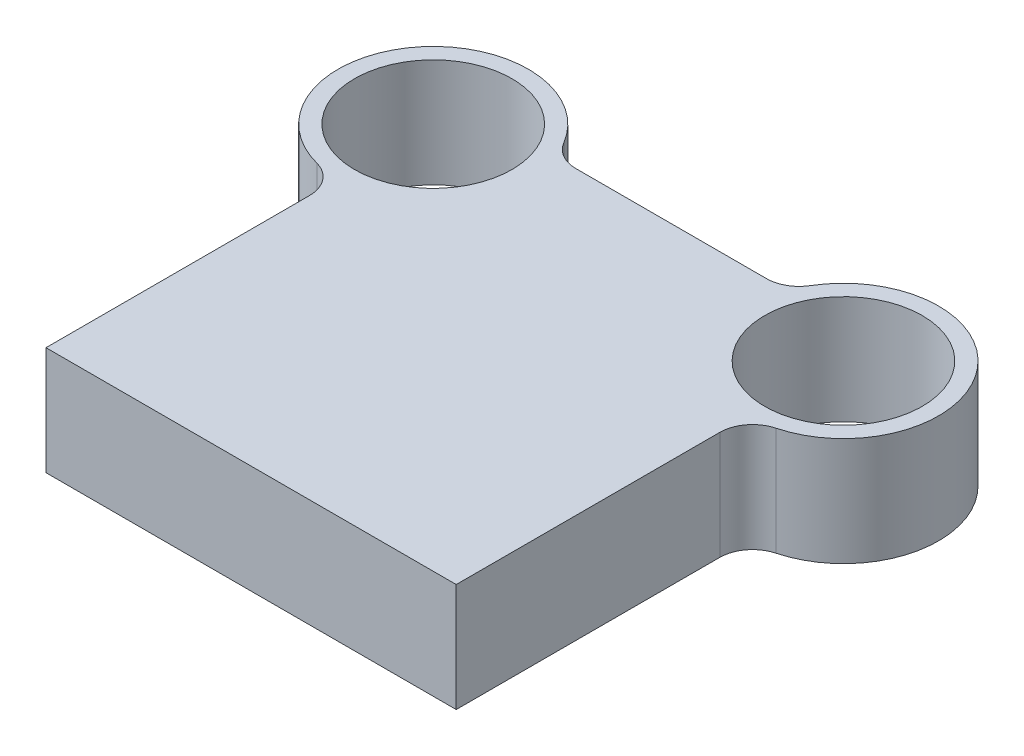
ISO-10303-21;
HEADER;
FILE_DESCRIPTION(('STEP AP214'),'2;1');
FILE_NAME('part.step','',(''),(''),'','','');
FILE_SCHEMA(('AUTOMOTIVE_DESIGN { 1 0 10303 214 1 1 1 1 }'));
ENDSEC;
DATA;
#1=APPLICATION_CONTEXT('core data for automotive mechanical design processes');
#2=APPLICATION_PROTOCOL_DEFINITION('international standard','automotive_design',2000,#1);
#3=PRODUCT_CONTEXT('',#1,'mechanical');
#4=PRODUCT('Part','Part','',(#3));
#5=PRODUCT_RELATED_PRODUCT_CATEGORY('part','',(#4));
#6=PRODUCT_DEFINITION_FORMATION('','',#4);
#7=PRODUCT_DEFINITION_CONTEXT('part definition',#1,'design');
#8=PRODUCT_DEFINITION('design','',#6,#7);
#9=PRODUCT_DEFINITION_SHAPE('','',#8);
#10=(LENGTH_UNIT() NAMED_UNIT(*) SI_UNIT(.MILLI.,.METRE.));
#11=(NAMED_UNIT(*) PLANE_ANGLE_UNIT() SI_UNIT($,.RADIAN.));
#12=(NAMED_UNIT(*) SI_UNIT($,.STERADIAN.) SOLID_ANGLE_UNIT());
#13=UNCERTAINTY_MEASURE_WITH_UNIT(LENGTH_MEASURE(1.E-05),#10,'distance_accuracy_value','');
#14=(GEOMETRIC_REPRESENTATION_CONTEXT(3) GLOBAL_UNCERTAINTY_ASSIGNED_CONTEXT((#13)) GLOBAL_UNIT_ASSIGNED_CONTEXT((#10,
#11,#12)) REPRESENTATION_CONTEXT('',''));
#15=CARTESIAN_POINT('',(0.,0.,0.));
#16=DIRECTION('',(0.,0.,1.));
#17=DIRECTION('',(1.,0.,0.));
#18=AXIS2_PLACEMENT_3D('',#15,#16,#17);
#19=CARTESIAN_POINT('',(-62.5,33.,-118.));
#20=DIRECTION('',(0.,1.,0.));
#21=DIRECTION('',(0.,0.,1.));
#22=AXIS2_PLACEMENT_3D('',#19,#20,#21);
#23=PLANE('',#22);
#24=CARTESIAN_POINT('',(-62.5,33.,-118.));
#25=DIRECTION('',(0.,1.,0.));
#26=DIRECTION('',(0.,0.,1.));
#27=AXIS2_PLACEMENT_3D('',#24,#25,#26);
#28=CIRCLE('',#27,24.);
#29=CARTESIAN_POINT('',(-62.5,33.,-94.));
#30=VERTEX_POINT('',#29);
#31=EDGE_CURVE('E209',#30,#30,#28,.T.);
#32=ORIENTED_EDGE('',*,*,#31,.F.);
#33=EDGE_LOOP('',(#32));
#34=FACE_BOUND('',#33,.T.);
#35=CARTESIAN_POINT('',(-62.5,33.,-118.));
#36=DIRECTION('',(0.,1.,0.));
#37=DIRECTION('',(0.,0.,1.));
#38=AXIS2_PLACEMENT_3D('',#35,#36,#37);
#39=CIRCLE('',#38,29.);
#40=CARTESIAN_POINT('',(-37.6036203979122,33.,-132.871794871795));
#41=VERTEX_POINT('',#40);
#42=CARTESIAN_POINT('',(-69.9358974358974,33.,-89.9695267731204));
#43=VERTEX_POINT('',#42);
#44=EDGE_CURVE('E139',#41,#43,#39,.T.);
#45=ORIENTED_EDGE('',*,*,#44,.T.);
#46=CARTESIAN_POINT('',(-72.5,33.,-80.3038463500584));
#47=DIRECTION('',(0.,1.,0.));
#48=DIRECTION('',(0.,0.,1.));
#49=AXIS2_PLACEMENT_3D('',#46,#47,#48);
#50=CIRCLE('',#49,10.);
#51=CARTESIAN_POINT('',(-62.5,33.,-80.3038463500584));
#52=VERTEX_POINT('',#51);
#53=EDGE_CURVE('E116',#43,#52,#50,.F.);
#54=ORIENTED_EDGE('',*,*,#53,.T.);
#55=DIRECTION('',(0.,0.,1.));
#56=VECTOR('',#55,1.);
#57=CARTESIAN_POINT('',(-62.5,33.,0.));
#58=LINE('',#57,#56);
#59=CARTESIAN_POINT('',(-62.5,33.,0.));
#60=VERTEX_POINT('',#59);
#61=EDGE_CURVE('E109',#52,#60,#58,.T.);
#62=ORIENTED_EDGE('',*,*,#61,.T.);
#63=DIRECTION('',(1.,0.,0.));
#64=VECTOR('',#63,1.);
#65=CARTESIAN_POINT('',(62.5,33.,0.));
#66=LINE('',#65,#64);
#67=CARTESIAN_POINT('',(62.5,33.,0.));
#68=VERTEX_POINT('',#67);
#69=EDGE_CURVE('E113',#60,#68,#66,.T.);
#70=ORIENTED_EDGE('',*,*,#69,.T.);
#71=DIRECTION('',(0.,0.,-1.));
#72=VECTOR('',#71,1.);
#73=CARTESIAN_POINT('',(62.5,33.,0.));
#74=LINE('',#73,#72);
#75=CARTESIAN_POINT('',(62.5,33.,-80.3038463500584));
#76=VERTEX_POINT('',#75);
#77=EDGE_CURVE('E129',#68,#76,#74,.T.);
#78=ORIENTED_EDGE('',*,*,#77,.T.);
#79=CARTESIAN_POINT('',(72.5,33.,-80.3038463500584));
#80=DIRECTION('',(0.,1.,0.));
#81=DIRECTION('',(0.,0.,1.));
#82=AXIS2_PLACEMENT_3D('',#79,#80,#81);
#83=CIRCLE('',#82,10.);
#84=CARTESIAN_POINT('',(69.9358974358974,33.,-89.9695267731204));
#85=VERTEX_POINT('',#84);
#86=EDGE_CURVE('E11',#76,#85,#83,.F.);
#87=ORIENTED_EDGE('',*,*,#86,.T.);
#88=CARTESIAN_POINT('',(62.5,33.,-118.));
#89=DIRECTION('',(0.,1.,0.));
#90=DIRECTION('',(0.,0.,-1.));
#91=AXIS2_PLACEMENT_3D('',#88,#89,#90);
#92=CIRCLE('',#91,29.);
#93=CARTESIAN_POINT('',(37.6036203979122,33.,-132.871794871795));
#94=VERTEX_POINT('',#93);
#95=EDGE_CURVE('E175',#85,#94,#92,.T.);
#96=ORIENTED_EDGE('',*,*,#95,.T.);
#97=CARTESIAN_POINT('',(29.0186619144336,33.,-138.));
#98=DIRECTION('',(0.,1.,0.));
#99=DIRECTION('',(0.,0.,1.));
#100=AXIS2_PLACEMENT_3D('',#97,#98,#99);
#101=CIRCLE('',#100,10.);
#102=CARTESIAN_POINT('',(29.0186619144336,33.,-128.));
#103=VERTEX_POINT('',#102);
#104=EDGE_CURVE('E167',#94,#103,#101,.F.);
#105=ORIENTED_EDGE('',*,*,#104,.T.);
#106=DIRECTION('',(-1.,0.,0.));
#107=VECTOR('',#106,1.);
#108=CARTESIAN_POINT('',(35.2786848223676,33.,-128.));
#109=LINE('',#108,#107);
#110=CARTESIAN_POINT('',(-29.0186619144336,33.,-128.));
#111=VERTEX_POINT('',#110);
#112=EDGE_CURVE('E172',#103,#111,#109,.T.);
#113=ORIENTED_EDGE('',*,*,#112,.T.);
#114=CARTESIAN_POINT('',(-29.0186619144336,33.,-138.));
#115=DIRECTION('',(0.,1.,0.));
#116=DIRECTION('',(0.,0.,1.));
#117=AXIS2_PLACEMENT_3D('',#114,#115,#116);
#118=CIRCLE('',#117,10.);
#119=EDGE_CURVE('E163',#111,#41,#118,.F.);
#120=ORIENTED_EDGE('',*,*,#119,.T.);
#121=EDGE_LOOP('',(#45,#54,#62,#70,#78,#87,#96,#105,#113,#120));
#122=FACE_BOUND('',#121,.T.);
#123=CARTESIAN_POINT('',(62.5,33.,-118.));
#124=DIRECTION('',(0.,1.,0.));
#125=DIRECTION('',(0.,0.,-1.));
#126=AXIS2_PLACEMENT_3D('',#123,#124,#125);
#127=CIRCLE('',#126,24.);
#128=CARTESIAN_POINT('',(62.5,33.,-142.));
#129=VERTEX_POINT('',#128);
#130=EDGE_CURVE('E219',#129,#129,#127,.T.);
#131=ORIENTED_EDGE('',*,*,#130,.F.);
#132=EDGE_LOOP('',(#131));
#133=FACE_BOUND('',#132,.T.);
#134=ADVANCED_FACE('F33',(#34,#122,#133),#23,.T.);
#135=CARTESIAN_POINT('',(-62.5,0.,-118.));
#136=DIRECTION('',(0.,1.,0.));
#137=DIRECTION('',(0.,0.,1.));
#138=AXIS2_PLACEMENT_3D('',#135,#136,#137);
#139=PLANE('',#138);
#140=DIRECTION('',(0.,0.,1.));
#141=VECTOR('',#140,1.);
#142=CARTESIAN_POINT('',(-62.5,0.,0.));
#143=LINE('',#142,#141);
#144=CARTESIAN_POINT('',(-62.5,0.,-80.3038463500584));
#145=VERTEX_POINT('',#144);
#146=CARTESIAN_POINT('',(-62.5,0.,0.));
#147=VERTEX_POINT('',#146);
#148=EDGE_CURVE('E133',#145,#147,#143,.T.);
#149=ORIENTED_EDGE('',*,*,#148,.F.);
#150=CARTESIAN_POINT('',(-72.5,0.,-80.3038463500584));
#151=DIRECTION('',(0.,1.,0.));
#152=DIRECTION('',(0.,0.,1.));
#153=AXIS2_PLACEMENT_3D('',#150,#151,#152);
#154=CIRCLE('',#153,10.);
#155=CARTESIAN_POINT('',(-69.9358974358974,0.,-89.9695267731204));
#156=VERTEX_POINT('',#155);
#157=EDGE_CURVE('E158',#145,#156,#154,.T.);
#158=ORIENTED_EDGE('',*,*,#157,.T.);
#159=CARTESIAN_POINT('',(-62.5,0.,-118.));
#160=DIRECTION('',(0.,1.,0.));
#161=DIRECTION('',(0.,0.,1.));
#162=AXIS2_PLACEMENT_3D('',#159,#160,#161);
#163=CIRCLE('',#162,29.);
#164=CARTESIAN_POINT('',(-37.6036203979122,0.,-132.871794871795));
#165=VERTEX_POINT('',#164);
#166=EDGE_CURVE('E121',#165,#156,#163,.T.);
#167=ORIENTED_EDGE('',*,*,#166,.F.);
#168=CARTESIAN_POINT('',(-29.0186619144336,0.,-138.));
#169=DIRECTION('',(0.,1.,0.));
#170=DIRECTION('',(0.,0.,1.));
#171=AXIS2_PLACEMENT_3D('',#168,#169,#170);
#172=CIRCLE('',#171,10.);
#173=CARTESIAN_POINT('',(-29.0186619144336,0.,-128.));
#174=VERTEX_POINT('',#173);
#175=EDGE_CURVE('E161',#165,#174,#172,.T.);
#176=ORIENTED_EDGE('',*,*,#175,.T.);
#177=DIRECTION('',(-1.,0.,0.));
#178=VECTOR('',#177,1.);
#179=CARTESIAN_POINT('',(35.2786848223676,0.,-128.));
#180=LINE('',#179,#178);
#181=CARTESIAN_POINT('',(29.0186619144336,0.,-128.));
#182=VERTEX_POINT('',#181);
#183=EDGE_CURVE('E190',#182,#174,#180,.T.);
#184=ORIENTED_EDGE('',*,*,#183,.F.);
#185=CARTESIAN_POINT('',(29.0186619144336,0.,-138.));
#186=DIRECTION('',(0.,1.,0.));
#187=DIRECTION('',(0.,0.,1.));
#188=AXIS2_PLACEMENT_3D('',#185,#186,#187);
#189=CIRCLE('',#188,10.);
#190=CARTESIAN_POINT('',(37.6036203979122,0.,-132.871794871795));
#191=VERTEX_POINT('',#190);
#192=EDGE_CURVE('E165',#182,#191,#189,.T.);
#193=ORIENTED_EDGE('',*,*,#192,.T.);
#194=CARTESIAN_POINT('',(62.5,0.,-118.));
#195=DIRECTION('',(0.,1.,0.));
#196=DIRECTION('',(0.,0.,-1.));
#197=AXIS2_PLACEMENT_3D('',#194,#195,#196);
#198=CIRCLE('',#197,29.);
#199=CARTESIAN_POINT('',(69.9358974358974,0.,-89.9695267731204));
#200=VERTEX_POINT('',#199);
#201=EDGE_CURVE('E189',#200,#191,#198,.T.);
#202=ORIENTED_EDGE('',*,*,#201,.F.);
#203=CARTESIAN_POINT('',(72.5,0.,-80.3038463500584));
#204=DIRECTION('',(0.,1.,0.));
#205=DIRECTION('',(0.,0.,1.));
#206=AXIS2_PLACEMENT_3D('',#203,#204,#205);
#207=CIRCLE('',#206,10.);
#208=CARTESIAN_POINT('',(62.5,0.,-80.3038463500584));
#209=VERTEX_POINT('',#208);
#210=EDGE_CURVE('E41',#200,#209,#207,.T.);
#211=ORIENTED_EDGE('',*,*,#210,.T.);
#212=DIRECTION('',(0.,0.,-1.));
#213=VECTOR('',#212,1.);
#214=CARTESIAN_POINT('',(62.5,0.,0.));
#215=LINE('',#214,#213);
#216=CARTESIAN_POINT('',(62.5,0.,0.));
#217=VERTEX_POINT('',#216);
#218=EDGE_CURVE('E194',#217,#209,#215,.T.);
#219=ORIENTED_EDGE('',*,*,#218,.F.);
#220=DIRECTION('',(1.,0.,0.));
#221=VECTOR('',#220,1.);
#222=CARTESIAN_POINT('',(62.5,0.,0.));
#223=LINE('',#222,#221);
#224=EDGE_CURVE('E197',#147,#217,#223,.T.);
#225=ORIENTED_EDGE('',*,*,#224,.F.);
#226=EDGE_LOOP('',(#149,#158,#167,#176,#184,#193,#202,#211,#219,#225));
#227=FACE_BOUND('',#226,.T.);
#228=CARTESIAN_POINT('',(-62.5,0.,-118.));
#229=DIRECTION('',(0.,1.,0.));
#230=DIRECTION('',(0.,0.,1.));
#231=AXIS2_PLACEMENT_3D('',#228,#229,#230);
#232=CIRCLE('',#231,24.);
#233=CARTESIAN_POINT('',(-62.5,0.,-94.));
#234=VERTEX_POINT('',#233);
#235=EDGE_CURVE('E212',#234,#234,#232,.T.);
#236=ORIENTED_EDGE('',*,*,#235,.T.);
#237=EDGE_LOOP('',(#236));
#238=FACE_BOUND('',#237,.T.);
#239=CARTESIAN_POINT('',(62.5,0.,-118.));
#240=DIRECTION('',(0.,1.,0.));
#241=DIRECTION('',(0.,0.,-1.));
#242=AXIS2_PLACEMENT_3D('',#239,#240,#241);
#243=CIRCLE('',#242,24.);
#244=CARTESIAN_POINT('',(62.5,0.,-142.));
#245=VERTEX_POINT('',#244);
#246=EDGE_CURVE('E221',#245,#245,#243,.T.);
#247=ORIENTED_EDGE('',*,*,#246,.T.);
#248=EDGE_LOOP('',(#247));
#249=FACE_BOUND('',#248,.T.);
#250=ADVANCED_FACE('F187',(#227,#238,#249),#139,.F.);
#251=CARTESIAN_POINT('',(-62.5,33.,0.));
#252=DIRECTION('',(1.,0.,0.));
#253=DIRECTION('',(0.,0.,-1.));
#254=AXIS2_PLACEMENT_3D('',#251,#252,#253);
#255=PLANE('',#254);
#256=ORIENTED_EDGE('',*,*,#61,.F.);
#257=DIRECTION('',(0.,1.,0.));
#258=VECTOR('',#257,1.);
#259=CARTESIAN_POINT('',(-62.5,0.,-80.3038463500584));
#260=LINE('',#259,#258);
#261=EDGE_CURVE('E135',#52,#145,#260,.F.);
#262=ORIENTED_EDGE('',*,*,#261,.T.);
#263=ORIENTED_EDGE('',*,*,#148,.T.);
#264=DIRECTION('',(0.,-1.,0.));
#265=VECTOR('',#264,1.);
#266=CARTESIAN_POINT('',(-62.5,33.,0.));
#267=LINE('',#266,#265);
#268=EDGE_CURVE('E126',#60,#147,#267,.T.);
#269=ORIENTED_EDGE('',*,*,#268,.F.);
#270=EDGE_LOOP('',(#256,#262,#263,#269));
#271=FACE_BOUND('',#270,.T.);
#272=ADVANCED_FACE('F131',(#271),#255,.F.);
#273=CARTESIAN_POINT('',(62.5,33.,0.));
#274=DIRECTION('',(0.,0.,-1.));
#275=DIRECTION('',(-1.,0.,0.));
#276=AXIS2_PLACEMENT_3D('',#273,#274,#275);
#277=PLANE('',#276);
#278=ORIENTED_EDGE('',*,*,#224,.T.);
#279=DIRECTION('',(0.,-1.,0.));
#280=VECTOR('',#279,1.);
#281=CARTESIAN_POINT('',(62.5,33.,0.));
#282=LINE('',#281,#280);
#283=EDGE_CURVE('E128',#68,#217,#282,.T.);
#284=ORIENTED_EDGE('',*,*,#283,.F.);
#285=ORIENTED_EDGE('',*,*,#69,.F.);
#286=ORIENTED_EDGE('',*,*,#268,.T.);
#287=EDGE_LOOP('',(#278,#284,#285,#286));
#288=FACE_BOUND('',#287,.T.);
#289=ADVANCED_FACE('F125',(#288),#277,.F.);
#290=CARTESIAN_POINT('',(62.5,33.,0.));
#291=DIRECTION('',(-1.,0.,0.));
#292=DIRECTION('',(0.,0.,1.));
#293=AXIS2_PLACEMENT_3D('',#290,#291,#292);
#294=PLANE('',#293);
#295=ORIENTED_EDGE('',*,*,#218,.T.);
#296=DIRECTION('',(0.,1.,0.));
#297=VECTOR('',#296,1.);
#298=CARTESIAN_POINT('',(62.5,33.,-80.3038463500584));
#299=LINE('',#298,#297);
#300=EDGE_CURVE('E48',#209,#76,#299,.T.);
#301=ORIENTED_EDGE('',*,*,#300,.T.);
#302=ORIENTED_EDGE('',*,*,#77,.F.);
#303=ORIENTED_EDGE('',*,*,#283,.T.);
#304=EDGE_LOOP('',(#295,#301,#302,#303));
#305=FACE_BOUND('',#304,.T.);
#306=ADVANCED_FACE('F247',(#305),#294,.F.);
#307=CARTESIAN_POINT('',(62.5,33.,-118.));
#308=DIRECTION('',(0.,-1.,0.));
#309=DIRECTION('',(0.,0.,-1.));
#310=AXIS2_PLACEMENT_3D('',#307,#308,#309);
#311=CYLINDRICAL_SURFACE('',#310,29.);
#312=ORIENTED_EDGE('',*,*,#201,.T.);
#313=DIRECTION('',(0.,-1.,0.));
#314=VECTOR('',#313,1.);
#315=CARTESIAN_POINT('',(37.6036203979122,33.,-132.871794871795));
#316=LINE('',#315,#314);
#317=EDGE_CURVE('E155',#191,#94,#316,.F.);
#318=ORIENTED_EDGE('',*,*,#317,.T.);
#319=ORIENTED_EDGE('',*,*,#95,.F.);
#320=DIRECTION('',(0.,-1.,0.));
#321=VECTOR('',#320,1.);
#322=CARTESIAN_POINT('',(69.9358974358974,33.,-89.9695267731204));
#323=LINE('',#322,#321);
#324=EDGE_CURVE('E152',#85,#200,#323,.T.);
#325=ORIENTED_EDGE('',*,*,#324,.T.);
#326=EDGE_LOOP('',(#312,#318,#319,#325));
#327=FACE_BOUND('',#326,.T.);
#328=ADVANCED_FACE('F192',(#327),#311,.T.);
#329=CARTESIAN_POINT('',(35.2786848223676,33.,-128.));
#330=DIRECTION('',(0.,0.,1.));
#331=DIRECTION('',(1.,0.,0.));
#332=AXIS2_PLACEMENT_3D('',#329,#330,#331);
#333=PLANE('',#332);
#334=ORIENTED_EDGE('',*,*,#183,.T.);
#335=DIRECTION('',(0.,1.,0.));
#336=VECTOR('',#335,1.);
#337=CARTESIAN_POINT('',(-29.0186619144336,33.,-128.));
#338=LINE('',#337,#336);
#339=EDGE_CURVE('E150',#174,#111,#338,.T.);
#340=ORIENTED_EDGE('',*,*,#339,.T.);
#341=ORIENTED_EDGE('',*,*,#112,.F.);
#342=DIRECTION('',(0.,1.,0.));
#343=VECTOR('',#342,1.);
#344=CARTESIAN_POINT('',(29.0186619144336,0.,-128.));
#345=LINE('',#344,#343);
#346=EDGE_CURVE('E147',#103,#182,#345,.F.);
#347=ORIENTED_EDGE('',*,*,#346,.T.);
#348=EDGE_LOOP('',(#334,#340,#341,#347));
#349=FACE_BOUND('',#348,.T.);
#350=ADVANCED_FACE('F181',(#349),#333,.F.);
#351=CARTESIAN_POINT('',(-62.5,33.,-118.));
#352=DIRECTION('',(0.,-1.,0.));
#353=DIRECTION('',(0.,0.,-1.));
#354=AXIS2_PLACEMENT_3D('',#351,#352,#353);
#355=CYLINDRICAL_SURFACE('',#354,29.);
#356=ORIENTED_EDGE('',*,*,#166,.T.);
#357=DIRECTION('',(0.,-1.,0.));
#358=VECTOR('',#357,1.);
#359=CARTESIAN_POINT('',(-69.9358974358974,33.,-89.9695267731204));
#360=LINE('',#359,#358);
#361=EDGE_CURVE('E145',#156,#43,#360,.F.);
#362=ORIENTED_EDGE('',*,*,#361,.T.);
#363=ORIENTED_EDGE('',*,*,#44,.F.);
#364=DIRECTION('',(0.,-1.,0.));
#365=VECTOR('',#364,1.);
#366=CARTESIAN_POINT('',(-37.6036203979122,33.,-132.871794871795));
#367=LINE('',#366,#365);
#368=EDGE_CURVE('E137',#41,#165,#367,.T.);
#369=ORIENTED_EDGE('',*,*,#368,.T.);
#370=EDGE_LOOP('',(#356,#362,#363,#369));
#371=FACE_BOUND('',#370,.T.);
#372=ADVANCED_FACE('F204',(#371),#355,.T.);
#373=CARTESIAN_POINT('',(-62.5,33.,-118.));
#374=DIRECTION('',(0.,-1.,0.));
#375=DIRECTION('',(0.,0.,-1.));
#376=AXIS2_PLACEMENT_3D('',#373,#374,#375);
#377=CYLINDRICAL_SURFACE('',#376,24.);
#378=ORIENTED_EDGE('',*,*,#31,.T.);
#379=EDGE_LOOP('',(#378));
#380=FACE_BOUND('',#379,.T.);
#381=ORIENTED_EDGE('',*,*,#235,.F.);
#382=EDGE_LOOP('',(#381));
#383=FACE_BOUND('',#382,.T.);
#384=ADVANCED_FACE('F238',(#380,#383),#377,.F.);
#385=CARTESIAN_POINT('',(62.5,33.,-118.));
#386=DIRECTION('',(0.,-1.,0.));
#387=DIRECTION('',(0.,0.,-1.));
#388=AXIS2_PLACEMENT_3D('',#385,#386,#387);
#389=CYLINDRICAL_SURFACE('',#388,24.);
#390=ORIENTED_EDGE('',*,*,#130,.T.);
#391=EDGE_LOOP('',(#390));
#392=FACE_BOUND('',#391,.T.);
#393=ORIENTED_EDGE('',*,*,#246,.F.);
#394=EDGE_LOOP('',(#393));
#395=FACE_BOUND('',#394,.T.);
#396=ADVANCED_FACE('F227',(#392,#395),#389,.F.);
#397=CARTESIAN_POINT('',(-72.5,33.,-80.3038463500584));
#398=DIRECTION('',(0.,-1.,0.));
#399=DIRECTION('',(0.,0.,-1.));
#400=AXIS2_PLACEMENT_3D('',#397,#398,#399);
#401=CYLINDRICAL_SURFACE('',#400,10.);
#402=ORIENTED_EDGE('',*,*,#53,.F.);
#403=ORIENTED_EDGE('',*,*,#361,.F.);
#404=ORIENTED_EDGE('',*,*,#157,.F.);
#405=ORIENTED_EDGE('',*,*,#261,.F.);
#406=EDGE_LOOP('',(#402,#403,#404,#405));
#407=FACE_BOUND('',#406,.T.);
#408=ADVANCED_FACE('F208',(#407),#401,.F.);
#409=CARTESIAN_POINT('',(-29.0186619144336,33.,-138.));
#410=DIRECTION('',(0.,-1.,0.));
#411=DIRECTION('',(0.,0.,-1.));
#412=AXIS2_PLACEMENT_3D('',#409,#410,#411);
#413=CYLINDRICAL_SURFACE('',#412,10.);
#414=ORIENTED_EDGE('',*,*,#119,.F.);
#415=ORIENTED_EDGE('',*,*,#339,.F.);
#416=ORIENTED_EDGE('',*,*,#175,.F.);
#417=ORIENTED_EDGE('',*,*,#368,.F.);
#418=EDGE_LOOP('',(#414,#415,#416,#417));
#419=FACE_BOUND('',#418,.T.);
#420=ADVANCED_FACE('F256',(#419),#413,.F.);
#421=CARTESIAN_POINT('',(29.0186619144336,33.,-138.));
#422=DIRECTION('',(0.,-1.,0.));
#423=DIRECTION('',(0.,0.,-1.));
#424=AXIS2_PLACEMENT_3D('',#421,#422,#423);
#425=CYLINDRICAL_SURFACE('',#424,10.);
#426=ORIENTED_EDGE('',*,*,#104,.F.);
#427=ORIENTED_EDGE('',*,*,#317,.F.);
#428=ORIENTED_EDGE('',*,*,#192,.F.);
#429=ORIENTED_EDGE('',*,*,#346,.F.);
#430=EDGE_LOOP('',(#426,#427,#428,#429));
#431=FACE_BOUND('',#430,.T.);
#432=ADVANCED_FACE('F185',(#431),#425,.F.);
#433=CARTESIAN_POINT('',(72.5,33.,-80.3038463500584));
#434=DIRECTION('',(0.,-1.,0.));
#435=DIRECTION('',(0.,0.,-1.));
#436=AXIS2_PLACEMENT_3D('',#433,#434,#435);
#437=CYLINDRICAL_SURFACE('',#436,10.);
#438=ORIENTED_EDGE('',*,*,#86,.F.);
#439=ORIENTED_EDGE('',*,*,#300,.F.);
#440=ORIENTED_EDGE('',*,*,#210,.F.);
#441=ORIENTED_EDGE('',*,*,#324,.F.);
#442=EDGE_LOOP('',(#438,#439,#440,#441));
#443=FACE_BOUND('',#442,.T.);
#444=ADVANCED_FACE('F35',(#443),#437,.F.);
#445=CLOSED_SHELL('',(#134,#250,#272,#289,#306,#328,#350,#372,#384,#396,#408,#420,#432,#444));
#446=MANIFOLD_SOLID_BREP('B2',#445);
#447=ADVANCED_BREP_SHAPE_REPRESENTATION('',(#18,#446),#14);
#448=SHAPE_DEFINITION_REPRESENTATION(#9,#447);
ENDSEC;
END-ISO-10303-21;
